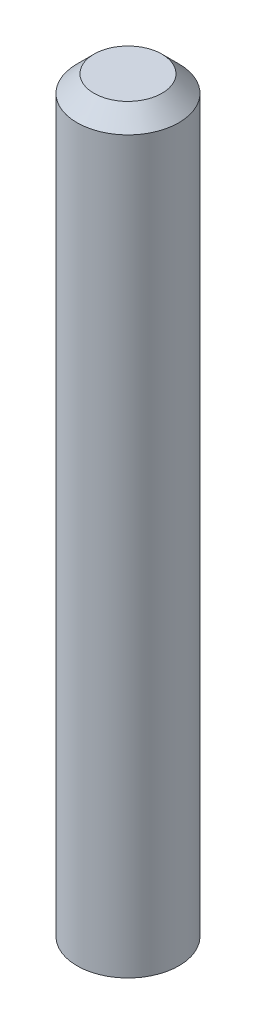
ISO-10303-21;
HEADER;
FILE_DESCRIPTION(('STEP AP214'),'2;1');
FILE_NAME('part.step','',(''),(''),'','','');
FILE_SCHEMA(('AUTOMOTIVE_DESIGN { 1 0 10303 214 1 1 1 1 }'));
ENDSEC;
DATA;
#1=APPLICATION_CONTEXT('core data for automotive mechanical design processes');
#2=APPLICATION_PROTOCOL_DEFINITION('international standard','automotive_design',2000,#1);
#3=PRODUCT_CONTEXT('',#1,'mechanical');
#4=PRODUCT('Part','Part','',(#3));
#5=PRODUCT_RELATED_PRODUCT_CATEGORY('part','',(#4));
#6=PRODUCT_DEFINITION_FORMATION('','',#4);
#7=PRODUCT_DEFINITION_CONTEXT('part definition',#1,'design');
#8=PRODUCT_DEFINITION('design','',#6,#7);
#9=PRODUCT_DEFINITION_SHAPE('','',#8);
#10=(LENGTH_UNIT() NAMED_UNIT(*) SI_UNIT(.MILLI.,.METRE.));
#11=(NAMED_UNIT(*) PLANE_ANGLE_UNIT() SI_UNIT($,.RADIAN.));
#12=(NAMED_UNIT(*) SI_UNIT($,.STERADIAN.) SOLID_ANGLE_UNIT());
#13=UNCERTAINTY_MEASURE_WITH_UNIT(LENGTH_MEASURE(1.E-05),#10,'distance_accuracy_value','');
#14=(GEOMETRIC_REPRESENTATION_CONTEXT(3) GLOBAL_UNCERTAINTY_ASSIGNED_CONTEXT((#13)) GLOBAL_UNIT_ASSIGNED_CONTEXT((#10,
#11,#12)) REPRESENTATION_CONTEXT('',''));
#15=CARTESIAN_POINT('',(0.,0.,0.));
#16=DIRECTION('',(0.,0.,1.));
#17=DIRECTION('',(1.,0.,0.));
#18=AXIS2_PLACEMENT_3D('',#15,#16,#17);
#19=CARTESIAN_POINT('',(-2.,22.,2.));
#20=DIRECTION('',(0.,1.,0.));
#21=DIRECTION('',(1.,0.,0.));
#22=AXIS2_PLACEMENT_3D('',#19,#20,#21);
#23=PLANE('',#22);
#24=CARTESIAN_POINT('',(0.,22.,0.));
#25=DIRECTION('',(0.,1.,0.));
#26=DIRECTION('',(0.,0.,-1.));
#27=AXIS2_PLACEMENT_3D('',#24,#25,#26);
#28=CIRCLE('',#27,2.);
#29=CARTESIAN_POINT('',(0.,22.,-2.));
#30=VERTEX_POINT('',#29);
#31=EDGE_CURVE('E25',#30,#30,#28,.F.);
#32=ORIENTED_EDGE('',*,*,#31,.F.);
#33=EDGE_LOOP('',(#32));
#34=FACE_BOUND('',#33,.T.);
#35=ADVANCED_FACE('F14',(#34),#23,.T.);
#36=CARTESIAN_POINT('',(-3.,-22.,-3.));
#37=DIRECTION('',(0.,-1.,0.));
#38=DIRECTION('',(1.,0.,0.));
#39=AXIS2_PLACEMENT_3D('',#36,#37,#38);
#40=PLANE('',#39);
#41=CARTESIAN_POINT('',(0.,-22.,0.));
#42=DIRECTION('',(0.,-1.,0.));
#43=DIRECTION('',(0.,0.,1.));
#44=AXIS2_PLACEMENT_3D('',#41,#42,#43);
#45=CIRCLE('',#44,3.);
#46=CARTESIAN_POINT('',(0.,-22.,3.));
#47=VERTEX_POINT('',#46);
#48=EDGE_CURVE('E21',#47,#47,#45,.T.);
#49=ORIENTED_EDGE('',*,*,#48,.T.);
#50=EDGE_LOOP('',(#49));
#51=FACE_BOUND('',#50,.T.);
#52=ADVANCED_FACE('F35',(#51),#40,.T.);
#53=CARTESIAN_POINT('',(0.,21.,0.));
#54=DIRECTION('',(0.,-1.,0.));
#55=DIRECTION('',(1.92332050626273E-10,0.,1.));
#56=AXIS2_PLACEMENT_3D('',#53,#54,#55);
#57=CONICAL_SURFACE('',#56,3.,0.785398163397448);
#58=CARTESIAN_POINT('',(0.,21.,0.));
#59=DIRECTION('',(0.,1.,0.));
#60=DIRECTION('',(0.,0.,-1.));
#61=AXIS2_PLACEMENT_3D('',#58,#59,#60);
#62=CIRCLE('',#61,3.);
#63=CARTESIAN_POINT('',(0.,21.,-3.));
#64=VERTEX_POINT('',#63);
#65=EDGE_CURVE('E9',#64,#64,#62,.F.);
#66=ORIENTED_EDGE('',*,*,#65,.F.);
#67=EDGE_LOOP('',(#66));
#68=FACE_BOUND('',#67,.T.);
#69=ORIENTED_EDGE('',*,*,#31,.T.);
#70=EDGE_LOOP('',(#69));
#71=FACE_BOUND('',#70,.T.);
#72=ADVANCED_FACE('F32',(#68,#71),#57,.T.);
#73=CARTESIAN_POINT('',(0.,-22.,0.));
#74=DIRECTION('',(0.,-1.,0.));
#75=DIRECTION('',(7.69327835111053E-10,0.,1.));
#76=AXIS2_PLACEMENT_3D('',#73,#74,#75);
#77=CYLINDRICAL_SURFACE('',#76,3.);
#78=ORIENTED_EDGE('',*,*,#48,.F.);
#79=EDGE_LOOP('',(#78));
#80=FACE_BOUND('',#79,.T.);
#81=ORIENTED_EDGE('',*,*,#65,.T.);
#82=EDGE_LOOP('',(#81));
#83=FACE_BOUND('',#82,.T.);
#84=ADVANCED_FACE('F16',(#80,#83),#77,.T.);
#85=CLOSED_SHELL('',(#35,#52,#72,#84));
#86=MANIFOLD_SOLID_BREP('B1',#85);
#87=ADVANCED_BREP_SHAPE_REPRESENTATION('',(#18,#86),#14);
#88=SHAPE_DEFINITION_REPRESENTATION(#9,#87);
ENDSEC;
END-ISO-10303-21;
